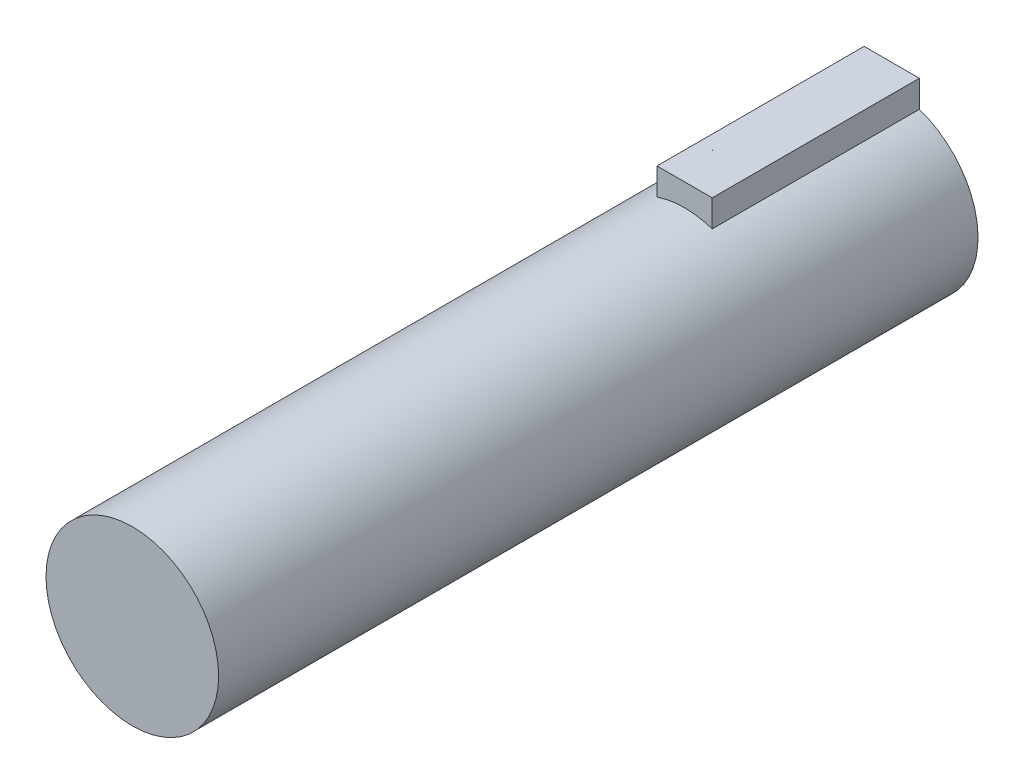
ISO-10303-21;
HEADER;
FILE_DESCRIPTION(('STEP AP214'),'2;1');
FILE_NAME('part.step','',(''),(''),'','','');
FILE_SCHEMA(('AUTOMOTIVE_DESIGN { 1 0 10303 214 1 1 1 1 }'));
ENDSEC;
DATA;
#1=APPLICATION_CONTEXT('core data for automotive mechanical design processes');
#2=APPLICATION_PROTOCOL_DEFINITION('international standard','automotive_design',2000,#1);
#3=PRODUCT_CONTEXT('',#1,'mechanical');
#4=PRODUCT('Part','Part','',(#3));
#5=PRODUCT_RELATED_PRODUCT_CATEGORY('part','',(#4));
#6=PRODUCT_DEFINITION_FORMATION('','',#4);
#7=PRODUCT_DEFINITION_CONTEXT('part definition',#1,'design');
#8=PRODUCT_DEFINITION('design','',#6,#7);
#9=PRODUCT_DEFINITION_SHAPE('','',#8);
#10=(LENGTH_UNIT() NAMED_UNIT(*) SI_UNIT(.MILLI.,.METRE.));
#11=(NAMED_UNIT(*) PLANE_ANGLE_UNIT() SI_UNIT($,.RADIAN.));
#12=(NAMED_UNIT(*) SI_UNIT($,.STERADIAN.) SOLID_ANGLE_UNIT());
#13=UNCERTAINTY_MEASURE_WITH_UNIT(LENGTH_MEASURE(1.E-05),#10,'distance_accuracy_value','');
#14=(GEOMETRIC_REPRESENTATION_CONTEXT(3) GLOBAL_UNCERTAINTY_ASSIGNED_CONTEXT((#13)) GLOBAL_UNIT_ASSIGNED_CONTEXT((#10,
#11,#12)) REPRESENTATION_CONTEXT('',''));
#15=CARTESIAN_POINT('',(0.,0.,0.));
#16=DIRECTION('',(0.,0.,1.));
#17=DIRECTION('',(1.,0.,0.));
#18=AXIS2_PLACEMENT_3D('',#15,#16,#17);
#19=CARTESIAN_POINT('',(0.,0.,0.));
#20=DIRECTION('',(0.,0.,1.));
#21=DIRECTION('',(1.,0.,0.));
#22=AXIS2_PLACEMENT_3D('',#19,#20,#21);
#23=PLANE('',#22);
#24=CARTESIAN_POINT('',(0.,0.,0.));
#25=DIRECTION('',(0.,0.,1.));
#26=DIRECTION('',(1.,0.,0.));
#27=AXIS2_PLACEMENT_3D('',#24,#25,#26);
#28=CIRCLE('',#27,12.5);
#29=CARTESIAN_POINT('',(-4.00000005960464,11.8427192621949,0.));
#30=VERTEX_POINT('',#29);
#31=CARTESIAN_POINT('',(-12.5,0.,0.));
#32=VERTEX_POINT('',#31);
#33=EDGE_CURVE('E11',#30,#32,#28,.T.);
#34=ORIENTED_EDGE('',*,*,#33,.F.);
#35=DIRECTION('',(0.,-1.,0.));
#36=VECTOR('',#35,1.);
#37=CARTESIAN_POINT('',(-4.00000005960464,15.7427192621949,0.));
#38=LINE('',#37,#36);
#39=CARTESIAN_POINT('',(-4.00000005960464,15.7427192621949,0.));
#40=VERTEX_POINT('',#39);
#41=EDGE_CURVE('E92',#40,#30,#38,.T.);
#42=ORIENTED_EDGE('',*,*,#41,.F.);
#43=DIRECTION('',(1.,0.,0.));
#44=VECTOR('',#43,1.);
#45=CARTESIAN_POINT('',(-4.00000005960464,15.7427192621949,0.));
#46=LINE('',#45,#44);
#47=CARTESIAN_POINT('',(4.00000005960464,15.7427192621949,0.));
#48=VERTEX_POINT('',#47);
#49=EDGE_CURVE('E94',#40,#48,#46,.T.);
#50=ORIENTED_EDGE('',*,*,#49,.T.);
#51=DIRECTION('',(0.,-1.,0.));
#52=VECTOR('',#51,1.);
#53=CARTESIAN_POINT('',(4.00000005960464,15.7427192621949,0.));
#54=LINE('',#53,#52);
#55=CARTESIAN_POINT('',(4.00000005960464,11.8427192621949,0.));
#56=VERTEX_POINT('',#55);
#57=EDGE_CURVE('E86',#48,#56,#54,.T.);
#58=ORIENTED_EDGE('',*,*,#57,.T.);
#59=CARTESIAN_POINT('',(0.,0.,0.));
#60=DIRECTION('',(0.,0.,1.));
#61=DIRECTION('',(1.,0.,0.));
#62=AXIS2_PLACEMENT_3D('',#59,#60,#61);
#63=CIRCLE('',#62,12.5);
#64=EDGE_CURVE('E27',#32,#56,#63,.T.);
#65=ORIENTED_EDGE('',*,*,#64,.F.);
#66=EDGE_LOOP('',(#34,#42,#50,#58,#65));
#67=FACE_BOUND('',#66,.T.);
#68=ADVANCED_FACE('F16',(#67),#23,.F.);
#69=CARTESIAN_POINT('',(0.,0.,110.));
#70=DIRECTION('',(0.,0.,1.));
#71=DIRECTION('',(1.,0.,0.));
#72=AXIS2_PLACEMENT_3D('',#69,#70,#71);
#73=PLANE('',#72);
#74=CARTESIAN_POINT('',(0.,0.,110.));
#75=DIRECTION('',(0.,0.,1.));
#76=DIRECTION('',(1.,0.,0.));
#77=AXIS2_PLACEMENT_3D('',#74,#75,#76);
#78=CIRCLE('',#77,12.5);
#79=CARTESIAN_POINT('',(-12.5,0.,110.));
#80=VERTEX_POINT('',#79);
#81=EDGE_CURVE('E119',#80,#80,#78,.T.);
#82=ORIENTED_EDGE('',*,*,#81,.T.);
#83=EDGE_LOOP('',(#82));
#84=FACE_BOUND('',#83,.T.);
#85=ADVANCED_FACE('F210',(#84),#73,.T.);
#86=CARTESIAN_POINT('',(0.,0.,0.));
#87=DIRECTION('',(0.,0.,1.));
#88=DIRECTION('',(1.,0.,0.));
#89=AXIS2_PLACEMENT_3D('',#86,#87,#88);
#90=CYLINDRICAL_SURFACE('',#89,12.5);
#91=ORIENTED_EDGE('',*,*,#81,.F.);
#92=DIRECTION('',(0.,0.,-1.));
#93=VECTOR('',#92,1.);
#94=CARTESIAN_POINT('',(-12.5,0.,0.));
#95=LINE('',#94,#93);
#96=EDGE_CURVE('E120',#80,#32,#95,.T.);
#97=ORIENTED_EDGE('',*,*,#96,.T.);
#98=ORIENTED_EDGE('',*,*,#64,.T.);
#99=DIRECTION('',(0.,0.,1.));
#100=VECTOR('',#99,1.);
#101=CARTESIAN_POINT('',(4.00000005960464,11.8427192621949,0.));
#102=LINE('',#101,#100);
#103=CARTESIAN_POINT('',(4.00000005960465,11.8427192621949,30.));
#104=VERTEX_POINT('',#103);
#105=EDGE_CURVE('E97',#56,#104,#102,.T.);
#106=ORIENTED_EDGE('',*,*,#105,.T.);
#107=CARTESIAN_POINT('',(0.,0.,30.));
#108=DIRECTION('',(0.,0.,1.));
#109=DIRECTION('',(1.,0.,0.));
#110=AXIS2_PLACEMENT_3D('',#107,#108,#109);
#111=CIRCLE('',#110,12.5);
#112=CARTESIAN_POINT('',(-4.00000005960464,11.8427192621949,30.));
#113=VERTEX_POINT('',#112);
#114=EDGE_CURVE('E59',#104,#113,#111,.T.);
#115=ORIENTED_EDGE('',*,*,#114,.T.);
#116=DIRECTION('',(0.,0.,-1.));
#117=VECTOR('',#116,1.);
#118=CARTESIAN_POINT('',(-4.00000005960464,11.8427192621949,0.));
#119=LINE('',#118,#117);
#120=EDGE_CURVE('E96',#113,#30,#119,.T.);
#121=ORIENTED_EDGE('',*,*,#120,.T.);
#122=ORIENTED_EDGE('',*,*,#33,.T.);
#123=ORIENTED_EDGE('',*,*,#96,.F.);
#124=EDGE_LOOP('',(#91,#97,#98,#106,#115,#121,#122,#123));
#125=FACE_BOUND('',#124,.T.);
#126=ADVANCED_FACE('F139',(#125),#90,.T.);
#127=CARTESIAN_POINT('',(0.,13.7927192621949,30.));
#128=DIRECTION('',(0.,0.,1.));
#129=DIRECTION('',(1.,0.,0.));
#130=AXIS2_PLACEMENT_3D('',#127,#128,#129);
#131=PLANE('',#130);
#132=DIRECTION('',(0.,-1.,0.));
#133=VECTOR('',#132,1.);
#134=CARTESIAN_POINT('',(-4.00000005960464,15.7427192621949,30.));
#135=LINE('',#134,#133);
#136=CARTESIAN_POINT('',(-4.00000005960464,15.7427192621949,30.));
#137=VERTEX_POINT('',#136);
#138=EDGE_CURVE('E20',#137,#113,#135,.T.);
#139=ORIENTED_EDGE('',*,*,#138,.T.);
#140=ORIENTED_EDGE('',*,*,#114,.F.);
#141=DIRECTION('',(0.,1.,0.));
#142=VECTOR('',#141,1.);
#143=CARTESIAN_POINT('',(4.00000005960464,15.7427192621949,30.));
#144=LINE('',#143,#142);
#145=CARTESIAN_POINT('',(4.00000005960465,15.7427192621949,30.));
#146=VERTEX_POINT('',#145);
#147=EDGE_CURVE('E114',#104,#146,#144,.T.);
#148=ORIENTED_EDGE('',*,*,#147,.T.);
#149=DIRECTION('',(-1.,0.,0.));
#150=VECTOR('',#149,1.);
#151=CARTESIAN_POINT('',(-4.00000005960464,15.7427192621949,30.));
#152=LINE('',#151,#150);
#153=EDGE_CURVE('E105',#146,#137,#152,.T.);
#154=ORIENTED_EDGE('',*,*,#153,.T.);
#155=EDGE_LOOP('',(#139,#140,#148,#154));
#156=FACE_BOUND('',#155,.T.);
#157=ADVANCED_FACE('F18',(#156),#131,.T.);
#158=CARTESIAN_POINT('',(-4.00000005960464,15.7427192621949,0.));
#159=DIRECTION('',(-1.,0.,0.));
#160=DIRECTION('',(0.,0.,1.));
#161=AXIS2_PLACEMENT_3D('',#158,#159,#160);
#162=PLANE('',#161);
#163=ORIENTED_EDGE('',*,*,#41,.T.);
#164=ORIENTED_EDGE('',*,*,#120,.F.);
#165=ORIENTED_EDGE('',*,*,#138,.F.);
#166=DIRECTION('',(0.,0.,1.));
#167=VECTOR('',#166,1.);
#168=CARTESIAN_POINT('',(-4.00000005960464,15.7427192621949,0.));
#169=LINE('',#168,#167);
#170=EDGE_CURVE('E100',#40,#137,#169,.T.);
#171=ORIENTED_EDGE('',*,*,#170,.F.);
#172=EDGE_LOOP('',(#163,#164,#165,#171));
#173=FACE_BOUND('',#172,.T.);
#174=ADVANCED_FACE('F101',(#173),#162,.T.);
#175=CARTESIAN_POINT('',(4.00000005960464,11.8427192621949,0.));
#176=DIRECTION('',(1.,0.,0.));
#177=DIRECTION('',(0.,1.,0.));
#178=AXIS2_PLACEMENT_3D('',#175,#176,#177);
#179=PLANE('',#178);
#180=ORIENTED_EDGE('',*,*,#57,.F.);
#181=DIRECTION('',(0.,0.,1.));
#182=VECTOR('',#181,1.);
#183=CARTESIAN_POINT('',(4.00000005960464,15.7427192621949,0.));
#184=LINE('',#183,#182);
#185=EDGE_CURVE('E108',#48,#146,#184,.T.);
#186=ORIENTED_EDGE('',*,*,#185,.T.);
#187=ORIENTED_EDGE('',*,*,#147,.F.);
#188=ORIENTED_EDGE('',*,*,#105,.F.);
#189=EDGE_LOOP('',(#180,#186,#187,#188));
#190=FACE_BOUND('',#189,.T.);
#191=ADVANCED_FACE('F141',(#190),#179,.T.);
#192=CARTESIAN_POINT('',(4.00000005960465,15.7427192621949,0.));
#193=DIRECTION('',(0.,1.,0.));
#194=DIRECTION('',(1.,0.,0.));
#195=AXIS2_PLACEMENT_3D('',#192,#193,#194);
#196=PLANE('',#195);
#197=ORIENTED_EDGE('',*,*,#49,.F.);
#198=ORIENTED_EDGE('',*,*,#170,.T.);
#199=ORIENTED_EDGE('',*,*,#153,.F.);
#200=ORIENTED_EDGE('',*,*,#185,.F.);
#201=EDGE_LOOP('',(#197,#198,#199,#200));
#202=FACE_BOUND('',#201,.T.);
#203=ADVANCED_FACE('F107',(#202),#196,.T.);
#204=CLOSED_SHELL('',(#68,#85,#126,#157,#174,#191,#203));
#205=MANIFOLD_SOLID_BREP('B1',#204);
#206=ADVANCED_BREP_SHAPE_REPRESENTATION('',(#18,#205),#14);
#207=SHAPE_DEFINITION_REPRESENTATION(#9,#206);
ENDSEC;
END-ISO-10303-21;
